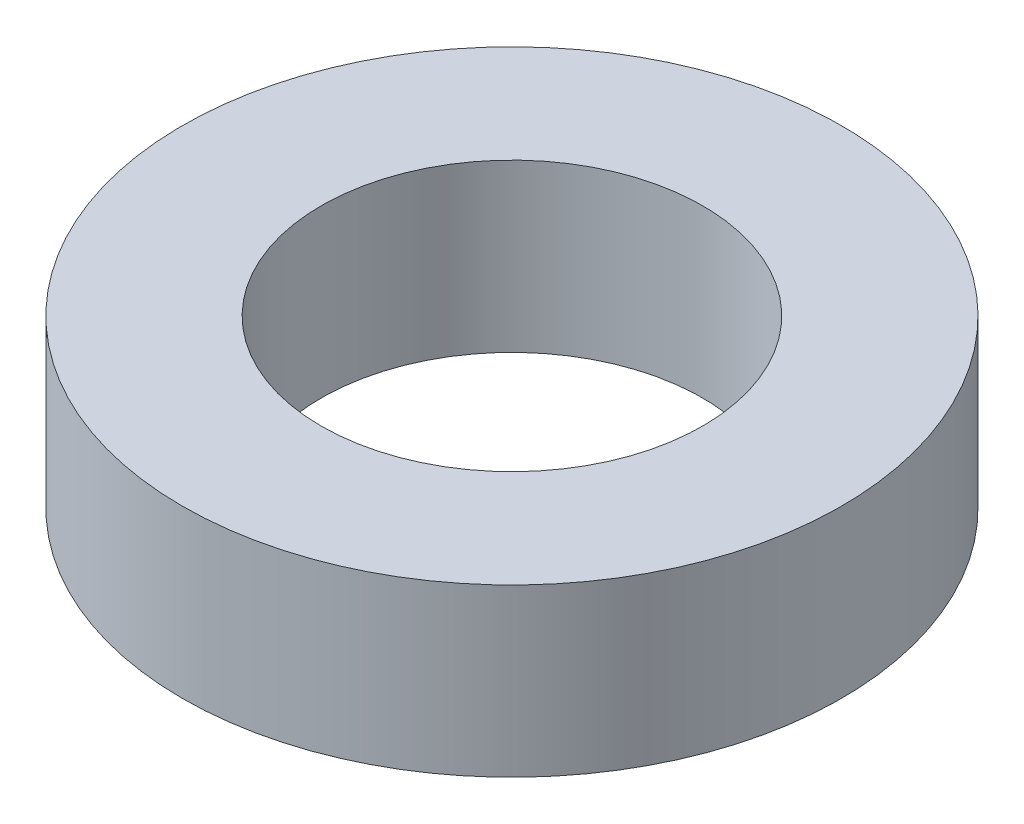
ISO-10303-21;
HEADER;
FILE_DESCRIPTION(('STEP AP214'),'2;1');
FILE_NAME('part.step','',(''),(''),'','','');
FILE_SCHEMA(('AUTOMOTIVE_DESIGN { 1 0 10303 214 1 1 1 1 }'));
ENDSEC;
DATA;
#1=APPLICATION_CONTEXT('core data for automotive mechanical design processes');
#2=APPLICATION_PROTOCOL_DEFINITION('international standard','automotive_design',2000,#1);
#3=PRODUCT_CONTEXT('',#1,'mechanical');
#4=PRODUCT('Part','Part','',(#3));
#5=PRODUCT_RELATED_PRODUCT_CATEGORY('part','',(#4));
#6=PRODUCT_DEFINITION_FORMATION('','',#4);
#7=PRODUCT_DEFINITION_CONTEXT('part definition',#1,'design');
#8=PRODUCT_DEFINITION('design','',#6,#7);
#9=PRODUCT_DEFINITION_SHAPE('','',#8);
#10=(LENGTH_UNIT() NAMED_UNIT(*) SI_UNIT(.MILLI.,.METRE.));
#11=(NAMED_UNIT(*) PLANE_ANGLE_UNIT() SI_UNIT($,.RADIAN.));
#12=(NAMED_UNIT(*) SI_UNIT($,.STERADIAN.) SOLID_ANGLE_UNIT());
#13=UNCERTAINTY_MEASURE_WITH_UNIT(LENGTH_MEASURE(1.E-05),#10,'distance_accuracy_value','');
#14=(GEOMETRIC_REPRESENTATION_CONTEXT(3) GLOBAL_UNCERTAINTY_ASSIGNED_CONTEXT((#13)) GLOBAL_UNIT_ASSIGNED_CONTEXT((#10,
#11,#12)) REPRESENTATION_CONTEXT('',''));
#15=CARTESIAN_POINT('',(0.,0.,0.));
#16=DIRECTION('',(0.,0.,1.));
#17=DIRECTION('',(1.,0.,0.));
#18=AXIS2_PLACEMENT_3D('',#15,#16,#17);
#19=CARTESIAN_POINT('',(0.,24.,0.));
#20=DIRECTION('',(0.,-1.,0.));
#21=DIRECTION('',(0.,0.,-1.));
#22=AXIS2_PLACEMENT_3D('',#19,#20,#21);
#23=CYLINDRICAL_SURFACE('',#22,47.5);
#24=CARTESIAN_POINT('',(0.,24.,0.));
#25=DIRECTION('',(0.,1.,0.));
#26=DIRECTION('',(0.,0.,1.));
#27=AXIS2_PLACEMENT_3D('',#24,#25,#26);
#28=CIRCLE('',#27,47.5);
#29=CARTESIAN_POINT('',(0.,24.,47.5));
#30=VERTEX_POINT('',#29);
#31=EDGE_CURVE('E10',#30,#30,#28,.T.);
#32=ORIENTED_EDGE('',*,*,#31,.F.);
#33=EDGE_LOOP('',(#32));
#34=FACE_BOUND('',#33,.T.);
#35=CARTESIAN_POINT('',(0.,0.,0.));
#36=DIRECTION('',(0.,1.,0.));
#37=DIRECTION('',(0.,0.,1.));
#38=AXIS2_PLACEMENT_3D('',#35,#36,#37);
#39=CIRCLE('',#38,47.5);
#40=CARTESIAN_POINT('',(0.,0.,47.5));
#41=VERTEX_POINT('',#40);
#42=EDGE_CURVE('E37',#41,#41,#39,.T.);
#43=ORIENTED_EDGE('',*,*,#42,.T.);
#44=EDGE_LOOP('',(#43));
#45=FACE_BOUND('',#44,.T.);
#46=ADVANCED_FACE('F40',(#34,#45),#23,.T.);
#47=CARTESIAN_POINT('',(0.,24.,0.));
#48=DIRECTION('',(0.,1.,0.));
#49=DIRECTION('',(0.,0.,1.));
#50=AXIS2_PLACEMENT_3D('',#47,#48,#49);
#51=PLANE('',#50);
#52=CARTESIAN_POINT('',(0.,24.,0.));
#53=DIRECTION('',(0.,1.,0.));
#54=DIRECTION('',(0.,0.,1.));
#55=AXIS2_PLACEMENT_3D('',#52,#53,#54);
#56=CIRCLE('',#55,27.5);
#57=CARTESIAN_POINT('',(0.,24.,27.5));
#58=VERTEX_POINT('',#57);
#59=EDGE_CURVE('E50',#58,#58,#56,.T.);
#60=ORIENTED_EDGE('',*,*,#59,.F.);
#61=EDGE_LOOP('',(#60));
#62=FACE_BOUND('',#61,.T.);
#63=ORIENTED_EDGE('',*,*,#31,.T.);
#64=EDGE_LOOP('',(#63));
#65=FACE_BOUND('',#64,.T.);
#66=ADVANCED_FACE('F59',(#62,#65),#51,.T.);
#67=CARTESIAN_POINT('',(0.,0.,0.));
#68=DIRECTION('',(0.,1.,0.));
#69=DIRECTION('',(0.,0.,1.));
#70=AXIS2_PLACEMENT_3D('',#67,#68,#69);
#71=PLANE('',#70);
#72=CARTESIAN_POINT('',(0.,0.,0.));
#73=DIRECTION('',(0.,1.,0.));
#74=DIRECTION('',(0.,0.,1.));
#75=AXIS2_PLACEMENT_3D('',#72,#73,#74);
#76=CIRCLE('',#75,27.5);
#77=CARTESIAN_POINT('',(0.,0.,27.5));
#78=VERTEX_POINT('',#77);
#79=EDGE_CURVE('E47',#78,#78,#76,.T.);
#80=ORIENTED_EDGE('',*,*,#79,.T.);
#81=EDGE_LOOP('',(#80));
#82=FACE_BOUND('',#81,.T.);
#83=ORIENTED_EDGE('',*,*,#42,.F.);
#84=EDGE_LOOP('',(#83));
#85=FACE_BOUND('',#84,.T.);
#86=ADVANCED_FACE('F58',(#82,#85),#71,.F.);
#87=CARTESIAN_POINT('',(0.,24.,0.));
#88=DIRECTION('',(0.,-1.,0.));
#89=DIRECTION('',(0.,0.,-1.));
#90=AXIS2_PLACEMENT_3D('',#87,#88,#89);
#91=CYLINDRICAL_SURFACE('',#90,27.5);
#92=ORIENTED_EDGE('',*,*,#59,.T.);
#93=EDGE_LOOP('',(#92));
#94=FACE_BOUND('',#93,.T.);
#95=ORIENTED_EDGE('',*,*,#79,.F.);
#96=EDGE_LOOP('',(#95));
#97=FACE_BOUND('',#96,.T.);
#98=ADVANCED_FACE('F54',(#94,#97),#91,.F.);
#99=CLOSED_SHELL('',(#46,#66,#86,#98));
#100=MANIFOLD_SOLID_BREP('B2',#99);
#101=ADVANCED_BREP_SHAPE_REPRESENTATION('',(#18,#100),#14);
#102=SHAPE_DEFINITION_REPRESENTATION(#9,#101);
ENDSEC;
END-ISO-10303-21;
